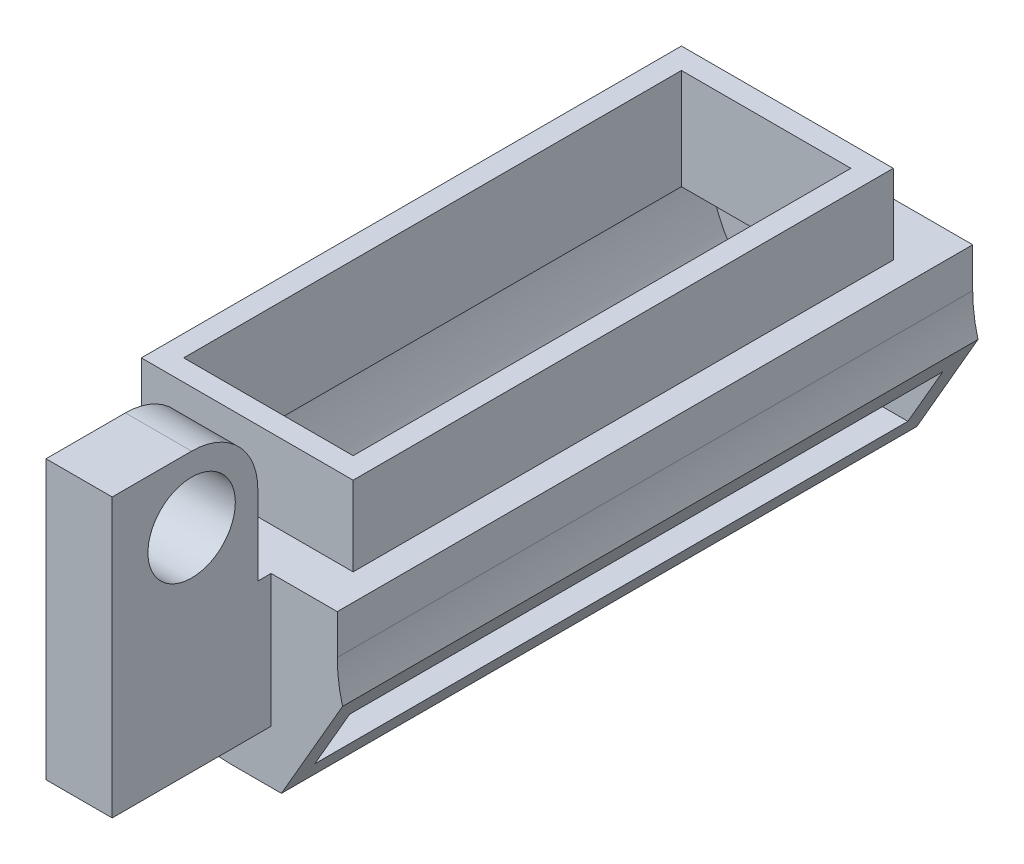
ISO-10303-21;
HEADER;
FILE_DESCRIPTION(('STEP AP214'),'2;1');
FILE_NAME('part.step','',(''),(''),'','','');
FILE_SCHEMA(('AUTOMOTIVE_DESIGN { 1 0 10303 214 1 1 1 1 }'));
ENDSEC;
DATA;
#1=APPLICATION_CONTEXT('core data for automotive mechanical design processes');
#2=APPLICATION_PROTOCOL_DEFINITION('international standard','automotive_design',2000,#1);
#3=PRODUCT_CONTEXT('',#1,'mechanical');
#4=PRODUCT('Part','Part','',(#3));
#5=PRODUCT_RELATED_PRODUCT_CATEGORY('part','',(#4));
#6=PRODUCT_DEFINITION_FORMATION('','',#4);
#7=PRODUCT_DEFINITION_CONTEXT('part definition',#1,'design');
#8=PRODUCT_DEFINITION('design','',#6,#7);
#9=PRODUCT_DEFINITION_SHAPE('','',#8);
#10=(LENGTH_UNIT() NAMED_UNIT(*) SI_UNIT(.MILLI.,.METRE.));
#11=(NAMED_UNIT(*) PLANE_ANGLE_UNIT() SI_UNIT($,.RADIAN.));
#12=(NAMED_UNIT(*) SI_UNIT($,.STERADIAN.) SOLID_ANGLE_UNIT());
#13=UNCERTAINTY_MEASURE_WITH_UNIT(LENGTH_MEASURE(1.E-05),#10,'distance_accuracy_value','');
#14=(GEOMETRIC_REPRESENTATION_CONTEXT(3) GLOBAL_UNCERTAINTY_ASSIGNED_CONTEXT((#13)) GLOBAL_UNIT_ASSIGNED_CONTEXT((#10,
#11,#12)) REPRESENTATION_CONTEXT('',''));
#15=CARTESIAN_POINT('',(0.,0.,0.));
#16=DIRECTION('',(0.,0.,1.));
#17=DIRECTION('',(1.,0.,0.));
#18=AXIS2_PLACEMENT_3D('',#15,#16,#17);
#19=CARTESIAN_POINT('',(5.2,-3.,12.));
#20=DIRECTION('',(-0.86602540378444,0.499999999999998,0.));
#21=DIRECTION('',(-0.499999999999998,-0.86602540378444,0.));
#22=AXIS2_PLACEMENT_3D('',#19,#20,#21);
#23=PLANE('',#22);
#24=DIRECTION('',(0.499999999999998,0.86602540378444,0.));
#25=VECTOR('',#24,1.);
#26=CARTESIAN_POINT('',(5.2,-3.,-12.));
#27=LINE('',#26,#25);
#28=CARTESIAN_POINT('',(2.89059892324151,-7.,-12.));
#29=VERTEX_POINT('',#28);
#30=CARTESIAN_POINT('',(5.2,-3.,-12.));
#31=VERTEX_POINT('',#30);
#32=EDGE_CURVE('E282',#29,#31,#27,.T.);
#33=ORIENTED_EDGE('',*,*,#32,.T.);
#34=DIRECTION('',(0.,0.,-1.));
#35=VECTOR('',#34,1.);
#36=CARTESIAN_POINT('',(5.2,-3.,12.));
#37=LINE('',#36,#35);
#38=CARTESIAN_POINT('',(5.2,-3.,12.));
#39=VERTEX_POINT('',#38);
#40=EDGE_CURVE('E288',#39,#31,#37,.T.);
#41=ORIENTED_EDGE('',*,*,#40,.F.);
#42=DIRECTION('',(0.499999999999998,0.86602540378444,0.));
#43=VECTOR('',#42,1.);
#44=CARTESIAN_POINT('',(5.2,-3.,12.));
#45=LINE('',#44,#43);
#46=CARTESIAN_POINT('',(2.89059892324151,-7.,12.));
#47=VERTEX_POINT('',#46);
#48=EDGE_CURVE('E265',#47,#39,#45,.T.);
#49=ORIENTED_EDGE('',*,*,#48,.F.);
#50=DIRECTION('',(0.,0.,-1.));
#51=VECTOR('',#50,1.);
#52=CARTESIAN_POINT('',(2.89059892324151,-7.,12.));
#53=LINE('',#52,#51);
#54=EDGE_CURVE('E291',#47,#29,#53,.T.);
#55=ORIENTED_EDGE('',*,*,#54,.T.);
#56=EDGE_LOOP('',(#33,#41,#49,#55));
#57=FACE_BOUND('',#56,.T.);
#58=DIRECTION('',(0.499999999999998,0.86602540378444,0.));
#59=VECTOR('',#58,1.);
#60=CARTESIAN_POINT('',(5.01602540378445,-3.31865334794731,-11.2));
#61=LINE('',#60,#59);
#62=CARTESIAN_POINT('',(3.35247913859321,-6.2,-11.2));
#63=VERTEX_POINT('',#62);
#64=CARTESIAN_POINT('',(4.6667832989844,-3.92355841760328,-11.2));
#65=VERTEX_POINT('',#64);
#66=EDGE_CURVE('E400',#63,#65,#61,.T.);
#67=ORIENTED_EDGE('',*,*,#66,.F.);
#68=DIRECTION('',(0.,0.,-1.));
#69=VECTOR('',#68,1.);
#70=CARTESIAN_POINT('',(3.35247913859321,-6.2,12.));
#71=LINE('',#70,#69);
#72=CARTESIAN_POINT('',(3.35247913859321,-6.2,11.2));
#73=VERTEX_POINT('',#72);
#74=EDGE_CURVE('E416',#73,#63,#71,.T.);
#75=ORIENTED_EDGE('',*,*,#74,.F.);
#76=DIRECTION('',(0.499999999999998,0.86602540378444,0.));
#77=VECTOR('',#76,1.);
#78=CARTESIAN_POINT('',(5.01602540378445,-3.31865334794731,11.2));
#79=LINE('',#78,#77);
#80=CARTESIAN_POINT('',(4.6667832989844,-3.92355841760328,11.2));
#81=VERTEX_POINT('',#80);
#82=EDGE_CURVE('E56',#73,#81,#79,.T.);
#83=ORIENTED_EDGE('',*,*,#82,.T.);
#84=DIRECTION('',(0.,0.,-1.));
#85=VECTOR('',#84,1.);
#86=CARTESIAN_POINT('',(4.6667832989844,-3.92355841760328,11.2));
#87=LINE('',#86,#85);
#88=EDGE_CURVE('E397',#81,#65,#87,.T.);
#89=ORIENTED_EDGE('',*,*,#88,.T.);
#90=EDGE_LOOP('',(#67,#75,#83,#89));
#91=FACE_BOUND('',#90,.T.);
#92=ADVANCED_FACE('F33',(#57,#91),#23,.F.);
#93=CARTESIAN_POINT('',(0.,3.,0.));
#94=DIRECTION('',(0.,-1.,0.));
#95=DIRECTION('',(1.,0.,0.));
#96=AXIS2_PLACEMENT_3D('',#93,#94,#95);
#97=PLANE('',#96);
#98=DIRECTION('',(0.,0.,-1.));
#99=VECTOR('',#98,1.);
#100=CARTESIAN_POINT('',(4.,3.,10.4));
#101=LINE('',#100,#99);
#102=CARTESIAN_POINT('',(4.,3.,10.4));
#103=VERTEX_POINT('',#102);
#104=CARTESIAN_POINT('',(4.,3.,-10.));
#105=VERTEX_POINT('',#104);
#106=EDGE_CURVE('E443',#103,#105,#101,.T.);
#107=ORIENTED_EDGE('',*,*,#106,.T.);
#108=DIRECTION('',(-1.,0.,0.));
#109=VECTOR('',#108,1.);
#110=CARTESIAN_POINT('',(-4.,3.,-10.));
#111=LINE('',#110,#109);
#112=CARTESIAN_POINT('',(-4.,3.,-10.));
#113=VERTEX_POINT('',#112);
#114=EDGE_CURVE('E446',#105,#113,#111,.T.);
#115=ORIENTED_EDGE('',*,*,#114,.T.);
#116=DIRECTION('',(0.,0.,1.));
#117=VECTOR('',#116,1.);
#118=CARTESIAN_POINT('',(-4.,3.,10.4));
#119=LINE('',#118,#117);
#120=CARTESIAN_POINT('',(-4.,3.,10.4));
#121=VERTEX_POINT('',#120);
#122=EDGE_CURVE('E449',#113,#121,#119,.T.);
#123=ORIENTED_EDGE('',*,*,#122,.T.);
#124=DIRECTION('',(1.,0.,0.));
#125=VECTOR('',#124,1.);
#126=CARTESIAN_POINT('',(-4.,3.,10.4));
#127=LINE('',#126,#125);
#128=EDGE_CURVE('E451',#121,#103,#127,.T.);
#129=ORIENTED_EDGE('',*,*,#128,.T.);
#130=EDGE_LOOP('',(#107,#115,#123,#129));
#131=FACE_BOUND('',#130,.T.);
#132=DIRECTION('',(0.,0.,-1.));
#133=VECTOR('',#132,1.);
#134=CARTESIAN_POINT('',(3.2,3.,0.));
#135=LINE('',#134,#133);
#136=CARTESIAN_POINT('',(3.2,3.,9.6));
#137=VERTEX_POINT('',#136);
#138=CARTESIAN_POINT('',(3.2,3.,-9.2));
#139=VERTEX_POINT('',#138);
#140=EDGE_CURVE('E382',#137,#139,#135,.T.);
#141=ORIENTED_EDGE('',*,*,#140,.F.);
#142=DIRECTION('',(1.,0.,0.));
#143=VECTOR('',#142,1.);
#144=CARTESIAN_POINT('',(0.,3.,9.6));
#145=LINE('',#144,#143);
#146=CARTESIAN_POINT('',(-3.2,3.,9.6));
#147=VERTEX_POINT('',#146);
#148=EDGE_CURVE('E425',#147,#137,#145,.T.);
#149=ORIENTED_EDGE('',*,*,#148,.F.);
#150=DIRECTION('',(0.,0.,1.));
#151=VECTOR('',#150,1.);
#152=CARTESIAN_POINT('',(-3.2,3.,0.));
#153=LINE('',#152,#151);
#154=CARTESIAN_POINT('',(-3.2,3.,-9.2));
#155=VERTEX_POINT('',#154);
#156=EDGE_CURVE('E439',#155,#147,#153,.T.);
#157=ORIENTED_EDGE('',*,*,#156,.F.);
#158=DIRECTION('',(-1.,0.,0.));
#159=VECTOR('',#158,1.);
#160=CARTESIAN_POINT('',(0.,3.,-9.2));
#161=LINE('',#160,#159);
#162=EDGE_CURVE('E437',#139,#155,#161,.T.);
#163=ORIENTED_EDGE('',*,*,#162,.F.);
#164=EDGE_LOOP('',(#141,#149,#157,#163));
#165=FACE_BOUND('',#164,.T.);
#166=ADVANCED_FACE('F488',(#131,#165),#97,.F.);
#167=CARTESIAN_POINT('',(-5.,0.,12.));
#168=DIRECTION('',(0.,-1.,0.));
#169=DIRECTION('',(1.,0.,0.));
#170=AXIS2_PLACEMENT_3D('',#167,#168,#169);
#171=PLANE('',#170);
#172=DIRECTION('',(-1.,0.,0.));
#173=VECTOR('',#172,1.);
#174=CARTESIAN_POINT('',(-5.,0.,-12.));
#175=LINE('',#174,#173);
#176=CARTESIAN_POINT('',(5.,0.,-12.));
#177=VERTEX_POINT('',#176);
#178=CARTESIAN_POINT('',(-5.,0.,-12.));
#179=VERTEX_POINT('',#178);
#180=EDGE_CURVE('E273',#177,#179,#175,.T.);
#181=ORIENTED_EDGE('',*,*,#180,.T.);
#182=DIRECTION('',(0.,0.,-1.));
#183=VECTOR('',#182,1.);
#184=CARTESIAN_POINT('',(-5.,0.,12.));
#185=LINE('',#184,#183);
#186=CARTESIAN_POINT('',(-5.,0.,12.));
#187=VERTEX_POINT('',#186);
#188=EDGE_CURVE('E41',#187,#179,#185,.T.);
#189=ORIENTED_EDGE('',*,*,#188,.F.);
#190=DIRECTION('',(-1.,0.,0.));
#191=VECTOR('',#190,1.);
#192=CARTESIAN_POINT('',(-5.,0.,12.));
#193=LINE('',#192,#191);
#194=CARTESIAN_POINT('',(0.,0.,12.));
#195=VERTEX_POINT('',#194);
#196=EDGE_CURVE('E255',#195,#187,#193,.T.);
#197=ORIENTED_EDGE('',*,*,#196,.F.);
#198=DIRECTION('',(0.,0.,1.));
#199=VECTOR('',#198,1.);
#200=CARTESIAN_POINT('',(0.,0.,12.));
#201=LINE('',#200,#199);
#202=CARTESIAN_POINT('',(0.,0.,12.5));
#203=VERTEX_POINT('',#202);
#204=EDGE_CURVE('E323',#195,#203,#201,.T.);
#205=ORIENTED_EDGE('',*,*,#204,.T.);
#206=DIRECTION('',(-1.,0.,0.));
#207=VECTOR('',#206,1.);
#208=CARTESIAN_POINT('',(2.5,0.,12.5));
#209=LINE('',#208,#207);
#210=CARTESIAN_POINT('',(2.5,0.,12.5));
#211=VERTEX_POINT('',#210);
#212=EDGE_CURVE('E234',#211,#203,#209,.T.);
#213=ORIENTED_EDGE('',*,*,#212,.F.);
#214=DIRECTION('',(0.,0.,1.));
#215=VECTOR('',#214,1.);
#216=CARTESIAN_POINT('',(2.5,0.,12.));
#217=LINE('',#216,#215);
#218=CARTESIAN_POINT('',(2.5,0.,12.));
#219=VERTEX_POINT('',#218);
#220=EDGE_CURVE('E226',#219,#211,#217,.T.);
#221=ORIENTED_EDGE('',*,*,#220,.F.);
#222=CARTESIAN_POINT('',(5.,0.,12.));
#223=VERTEX_POINT('',#222);
#224=EDGE_CURVE('E231',#223,#219,#193,.T.);
#225=ORIENTED_EDGE('',*,*,#224,.F.);
#226=DIRECTION('',(0.,0.,-1.));
#227=VECTOR('',#226,1.);
#228=CARTESIAN_POINT('',(5.,0.,12.));
#229=LINE('',#228,#227);
#230=EDGE_CURVE('E11',#223,#177,#229,.T.);
#231=ORIENTED_EDGE('',*,*,#230,.T.);
#232=EDGE_LOOP('',(#181,#189,#197,#205,#213,#221,#225,#231));
#233=FACE_BOUND('',#232,.T.);
#234=DIRECTION('',(0.,0.,-1.));
#235=VECTOR('',#234,1.);
#236=CARTESIAN_POINT('',(4.,0.,10.4));
#237=LINE('',#236,#235);
#238=CARTESIAN_POINT('',(4.,0.,10.4));
#239=VERTEX_POINT('',#238);
#240=CARTESIAN_POINT('',(4.,0.,-10.));
#241=VERTEX_POINT('',#240);
#242=EDGE_CURVE('E375',#239,#241,#237,.T.);
#243=ORIENTED_EDGE('',*,*,#242,.F.);
#244=DIRECTION('',(1.,0.,0.));
#245=VECTOR('',#244,1.);
#246=CARTESIAN_POINT('',(-4.,0.,10.4));
#247=LINE('',#246,#245);
#248=CARTESIAN_POINT('',(-4.,0.,10.4));
#249=VERTEX_POINT('',#248);
#250=EDGE_CURVE('E447',#249,#239,#247,.T.);
#251=ORIENTED_EDGE('',*,*,#250,.F.);
#252=DIRECTION('',(0.,0.,1.));
#253=VECTOR('',#252,1.);
#254=CARTESIAN_POINT('',(-4.,0.,10.4));
#255=LINE('',#254,#253);
#256=CARTESIAN_POINT('',(-4.,0.,-10.));
#257=VERTEX_POINT('',#256);
#258=EDGE_CURVE('E459',#257,#249,#255,.T.);
#259=ORIENTED_EDGE('',*,*,#258,.F.);
#260=DIRECTION('',(-1.,0.,0.));
#261=VECTOR('',#260,1.);
#262=CARTESIAN_POINT('',(-4.,0.,-10.));
#263=LINE('',#262,#261);
#264=EDGE_CURVE('E456',#241,#257,#263,.T.);
#265=ORIENTED_EDGE('',*,*,#264,.F.);
#266=EDGE_LOOP('',(#243,#251,#259,#265));
#267=FACE_BOUND('',#266,.T.);
#268=ADVANCED_FACE('F228',(#233,#267),#171,.F.);
#269=CARTESIAN_POINT('',(5.,-1.5,12.));
#270=DIRECTION('',(-1.,0.,0.));
#271=DIRECTION('',(0.,0.,1.));
#272=AXIS2_PLACEMENT_3D('',#269,#270,#271);
#273=PLANE('',#272);
#274=DIRECTION('',(0.,1.,0.));
#275=VECTOR('',#274,1.);
#276=CARTESIAN_POINT('',(5.,-1.5,-12.));
#277=LINE('',#276,#275);
#278=CARTESIAN_POINT('',(5.,-1.5,-12.));
#279=VERTEX_POINT('',#278);
#280=EDGE_CURVE('E270',#279,#177,#277,.T.);
#281=ORIENTED_EDGE('',*,*,#280,.T.);
#282=ORIENTED_EDGE('',*,*,#230,.F.);
#283=DIRECTION('',(0.,1.,0.));
#284=VECTOR('',#283,1.);
#285=CARTESIAN_POINT('',(5.,-1.5,12.));
#286=LINE('',#285,#284);
#287=CARTESIAN_POINT('',(5.,-1.5,12.));
#288=VERTEX_POINT('',#287);
#289=EDGE_CURVE('E252',#288,#223,#286,.T.);
#290=ORIENTED_EDGE('',*,*,#289,.F.);
#291=DIRECTION('',(0.,0.,-1.));
#292=VECTOR('',#291,1.);
#293=CARTESIAN_POINT('',(5.,-1.5,12.));
#294=LINE('',#293,#292);
#295=EDGE_CURVE('E269',#288,#279,#294,.T.);
#296=ORIENTED_EDGE('',*,*,#295,.T.);
#297=EDGE_LOOP('',(#281,#282,#290,#296));
#298=FACE_BOUND('',#297,.T.);
#299=ADVANCED_FACE('F35',(#298),#273,.F.);
#300=CARTESIAN_POINT('',(-5.,-1.,12.));
#301=DIRECTION('',(1.,0.,0.));
#302=DIRECTION('',(0.,1.,0.));
#303=AXIS2_PLACEMENT_3D('',#300,#301,#302);
#304=PLANE('',#303);
#305=DIRECTION('',(0.,-1.,0.));
#306=VECTOR('',#305,1.);
#307=CARTESIAN_POINT('',(-5.,-1.,-12.));
#308=LINE('',#307,#306);
#309=CARTESIAN_POINT('',(-5.,-1.,-12.));
#310=VERTEX_POINT('',#309);
#311=EDGE_CURVE('E276',#179,#310,#308,.T.);
#312=ORIENTED_EDGE('',*,*,#311,.T.);
#313=DIRECTION('',(0.,0.,-1.));
#314=VECTOR('',#313,1.);
#315=CARTESIAN_POINT('',(-5.,-1.,12.));
#316=LINE('',#315,#314);
#317=CARTESIAN_POINT('',(-5.,-1.,12.));
#318=VERTEX_POINT('',#317);
#319=EDGE_CURVE('E297',#318,#310,#316,.T.);
#320=ORIENTED_EDGE('',*,*,#319,.F.);
#321=DIRECTION('',(0.,-1.,0.));
#322=VECTOR('',#321,1.);
#323=CARTESIAN_POINT('',(-5.,-1.,12.));
#324=LINE('',#323,#322);
#325=EDGE_CURVE('E254',#187,#318,#324,.T.);
#326=ORIENTED_EDGE('',*,*,#325,.F.);
#327=ORIENTED_EDGE('',*,*,#188,.T.);
#328=EDGE_LOOP('',(#312,#320,#326,#327));
#329=FACE_BOUND('',#328,.T.);
#330=ADVANCED_FACE('F304',(#329),#304,.F.);
#331=CARTESIAN_POINT('',(1.,-1.,12.));
#332=DIRECTION('',(0.,0.,-1.));
#333=DIRECTION('',(-1.,0.,0.));
#334=AXIS2_PLACEMENT_3D('',#331,#332,#333);
#335=CYLINDRICAL_SURFACE('',#334,6.);
#336=CARTESIAN_POINT('',(1.,-1.,-12.));
#337=DIRECTION('',(0.,0.,1.));
#338=DIRECTION('',(-1.,0.,0.));
#339=AXIS2_PLACEMENT_3D('',#336,#337,#338);
#340=CIRCLE('',#339,6.);
#341=CARTESIAN_POINT('',(1.,-7.,-12.));
#342=VERTEX_POINT('',#341);
#343=EDGE_CURVE('E278',#310,#342,#340,.T.);
#344=ORIENTED_EDGE('',*,*,#343,.T.);
#345=DIRECTION('',(0.,0.,-1.));
#346=VECTOR('',#345,1.);
#347=CARTESIAN_POINT('',(1.,-7.,12.));
#348=LINE('',#347,#346);
#349=CARTESIAN_POINT('',(1.,-7.,12.));
#350=VERTEX_POINT('',#349);
#351=EDGE_CURVE('E294',#350,#342,#348,.T.);
#352=ORIENTED_EDGE('',*,*,#351,.F.);
#353=CARTESIAN_POINT('',(1.,-1.,12.));
#354=DIRECTION('',(0.,0.,1.));
#355=DIRECTION('',(-1.,0.,0.));
#356=AXIS2_PLACEMENT_3D('',#353,#354,#355);
#357=CIRCLE('',#356,6.);
#358=EDGE_CURVE('E257',#318,#350,#357,.T.);
#359=ORIENTED_EDGE('',*,*,#358,.F.);
#360=ORIENTED_EDGE('',*,*,#319,.T.);
#361=EDGE_LOOP('',(#344,#352,#359,#360));
#362=FACE_BOUND('',#361,.T.);
#363=ADVANCED_FACE('F315',(#362),#335,.T.);
#364=CARTESIAN_POINT('',(2.89059892324151,-7.,12.));
#365=DIRECTION('',(0.,1.,0.));
#366=DIRECTION('',(0.,0.,1.));
#367=AXIS2_PLACEMENT_3D('',#364,#365,#366);
#368=PLANE('',#367);
#369=DIRECTION('',(1.,0.,0.));
#370=VECTOR('',#369,1.);
#371=CARTESIAN_POINT('',(2.89059892324151,-7.,-12.));
#372=LINE('',#371,#370);
#373=EDGE_CURVE('E280',#342,#29,#372,.T.);
#374=ORIENTED_EDGE('',*,*,#373,.T.);
#375=ORIENTED_EDGE('',*,*,#54,.F.);
#376=DIRECTION('',(1.,0.,0.));
#377=VECTOR('',#376,1.);
#378=CARTESIAN_POINT('',(2.89059892324151,-7.,12.));
#379=LINE('',#378,#377);
#380=EDGE_CURVE('E263',#350,#47,#379,.T.);
#381=ORIENTED_EDGE('',*,*,#380,.F.);
#382=ORIENTED_EDGE('',*,*,#351,.T.);
#383=EDGE_LOOP('',(#374,#375,#381,#382));
#384=FACE_BOUND('',#383,.T.);
#385=ADVANCED_FACE('F319',(#384),#368,.F.);
#386=CARTESIAN_POINT('',(10.7250000000001,-1.49999999999999,12.));
#387=DIRECTION('',(0.,0.,-1.));
#388=DIRECTION('',(-1.,0.,0.));
#389=AXIS2_PLACEMENT_3D('',#386,#387,#388);
#390=CYLINDRICAL_SURFACE('',#389,5.72500000000009);
#391=CARTESIAN_POINT('',(10.7250000000001,-1.49999999999999,-12.));
#392=DIRECTION('',(0.,0.,-1.));
#393=DIRECTION('',(1.,0.,0.));
#394=AXIS2_PLACEMENT_3D('',#391,#392,#393);
#395=CIRCLE('',#394,5.72500000000009);
#396=EDGE_CURVE('E284',#31,#279,#395,.T.);
#397=ORIENTED_EDGE('',*,*,#396,.T.);
#398=ORIENTED_EDGE('',*,*,#295,.F.);
#399=CARTESIAN_POINT('',(10.7250000000001,-1.49999999999999,12.));
#400=DIRECTION('',(0.,0.,-1.));
#401=DIRECTION('',(1.,0.,0.));
#402=AXIS2_PLACEMENT_3D('',#399,#400,#401);
#403=CIRCLE('',#402,5.72500000000009);
#404=EDGE_CURVE('E267',#39,#288,#403,.T.);
#405=ORIENTED_EDGE('',*,*,#404,.F.);
#406=ORIENTED_EDGE('',*,*,#40,.T.);
#407=EDGE_LOOP('',(#397,#398,#405,#406));
#408=FACE_BOUND('',#407,.T.);
#409=ADVANCED_FACE('F525',(#408),#390,.F.);
#410=CARTESIAN_POINT('',(1.,-1.,12.));
#411=DIRECTION('',(0.,0.,-1.));
#412=DIRECTION('',(-1.,0.,0.));
#413=AXIS2_PLACEMENT_3D('',#410,#411,#412);
#414=PLANE('',#413);
#415=DIRECTION('',(-1.,0.,0.));
#416=VECTOR('',#415,1.);
#417=CARTESIAN_POINT('',(2.5,-5.,12.));
#418=LINE('',#417,#416);
#419=CARTESIAN_POINT('',(2.5,-5.,12.));
#420=VERTEX_POINT('',#419);
#421=CARTESIAN_POINT('',(0.,-5.,12.));
#422=VERTEX_POINT('',#421);
#423=EDGE_CURVE('E348',#420,#422,#418,.T.);
#424=ORIENTED_EDGE('',*,*,#423,.T.);
#425=DIRECTION('',(0.,1.,0.));
#426=VECTOR('',#425,1.);
#427=CARTESIAN_POINT('',(0.,-5.,12.));
#428=LINE('',#427,#426);
#429=EDGE_CURVE('E48',#422,#195,#428,.T.);
#430=ORIENTED_EDGE('',*,*,#429,.T.);
#431=ORIENTED_EDGE('',*,*,#196,.T.);
#432=ORIENTED_EDGE('',*,*,#325,.T.);
#433=ORIENTED_EDGE('',*,*,#358,.T.);
#434=ORIENTED_EDGE('',*,*,#380,.T.);
#435=ORIENTED_EDGE('',*,*,#48,.T.);
#436=ORIENTED_EDGE('',*,*,#404,.T.);
#437=ORIENTED_EDGE('',*,*,#289,.T.);
#438=ORIENTED_EDGE('',*,*,#224,.T.);
#439=DIRECTION('',(0.,1.,0.));
#440=VECTOR('',#439,1.);
#441=CARTESIAN_POINT('',(2.5,-5.,12.));
#442=LINE('',#441,#440);
#443=EDGE_CURVE('E238',#420,#219,#442,.T.);
#444=ORIENTED_EDGE('',*,*,#443,.F.);
#445=EDGE_LOOP('',(#424,#430,#431,#432,#433,#434,#435,#436,#437,#438,#444));
#446=FACE_BOUND('',#445,.T.);
#447=ADVANCED_FACE('F250',(#446),#414,.F.);
#448=CARTESIAN_POINT('',(1.,-1.,-12.));
#449=DIRECTION('',(0.,0.,-1.));
#450=DIRECTION('',(-1.,0.,0.));
#451=AXIS2_PLACEMENT_3D('',#448,#449,#450);
#452=PLANE('',#451);
#453=ORIENTED_EDGE('',*,*,#280,.F.);
#454=ORIENTED_EDGE('',*,*,#396,.F.);
#455=ORIENTED_EDGE('',*,*,#32,.F.);
#456=ORIENTED_EDGE('',*,*,#373,.F.);
#457=ORIENTED_EDGE('',*,*,#343,.F.);
#458=ORIENTED_EDGE('',*,*,#311,.F.);
#459=ORIENTED_EDGE('',*,*,#180,.F.);
#460=EDGE_LOOP('',(#453,#454,#455,#456,#457,#458,#459));
#461=FACE_BOUND('',#460,.T.);
#462=ADVANCED_FACE('F310',(#461),#452,.T.);
#463=CARTESIAN_POINT('',(4.,3.,10.4));
#464=DIRECTION('',(-1.,0.,0.));
#465=DIRECTION('',(0.,-1.,0.));
#466=AXIS2_PLACEMENT_3D('',#463,#464,#465);
#467=PLANE('',#466);
#468=ORIENTED_EDGE('',*,*,#242,.T.);
#469=DIRECTION('',(0.,-1.,0.));
#470=VECTOR('',#469,1.);
#471=CARTESIAN_POINT('',(4.,3.,-10.));
#472=LINE('',#471,#470);
#473=EDGE_CURVE('E274',#105,#241,#472,.T.);
#474=ORIENTED_EDGE('',*,*,#473,.F.);
#475=ORIENTED_EDGE('',*,*,#106,.F.);
#476=DIRECTION('',(0.,-1.,0.));
#477=VECTOR('',#476,1.);
#478=CARTESIAN_POINT('',(4.,3.,10.4));
#479=LINE('',#478,#477);
#480=EDGE_CURVE('E453',#103,#239,#479,.T.);
#481=ORIENTED_EDGE('',*,*,#480,.T.);
#482=EDGE_LOOP('',(#468,#474,#475,#481));
#483=FACE_BOUND('',#482,.T.);
#484=ADVANCED_FACE('F478',(#483),#467,.F.);
#485=CARTESIAN_POINT('',(-4.,3.,-10.));
#486=DIRECTION('',(0.,0.,1.));
#487=DIRECTION('',(1.,0.,0.));
#488=AXIS2_PLACEMENT_3D('',#485,#486,#487);
#489=PLANE('',#488);
#490=ORIENTED_EDGE('',*,*,#264,.T.);
#491=DIRECTION('',(0.,-1.,0.));
#492=VECTOR('',#491,1.);
#493=CARTESIAN_POINT('',(-4.,3.,-10.));
#494=LINE('',#493,#492);
#495=EDGE_CURVE('E469',#113,#257,#494,.T.);
#496=ORIENTED_EDGE('',*,*,#495,.F.);
#497=ORIENTED_EDGE('',*,*,#114,.F.);
#498=ORIENTED_EDGE('',*,*,#473,.T.);
#499=EDGE_LOOP('',(#490,#496,#497,#498));
#500=FACE_BOUND('',#499,.T.);
#501=ADVANCED_FACE('F474',(#500),#489,.F.);
#502=CARTESIAN_POINT('',(-4.,3.,10.4));
#503=DIRECTION('',(1.,0.,0.));
#504=DIRECTION('',(0.,1.,0.));
#505=AXIS2_PLACEMENT_3D('',#502,#503,#504);
#506=PLANE('',#505);
#507=ORIENTED_EDGE('',*,*,#258,.T.);
#508=DIRECTION('',(0.,-1.,0.));
#509=VECTOR('',#508,1.);
#510=CARTESIAN_POINT('',(-4.,3.,10.4));
#511=LINE('',#510,#509);
#512=EDGE_CURVE('E466',#121,#249,#511,.T.);
#513=ORIENTED_EDGE('',*,*,#512,.F.);
#514=ORIENTED_EDGE('',*,*,#122,.F.);
#515=ORIENTED_EDGE('',*,*,#495,.T.);
#516=EDGE_LOOP('',(#507,#513,#514,#515));
#517=FACE_BOUND('',#516,.T.);
#518=ADVANCED_FACE('F486',(#517),#506,.F.);
#519=CARTESIAN_POINT('',(-4.,3.,10.4));
#520=DIRECTION('',(0.,0.,-1.));
#521=DIRECTION('',(-1.,0.,0.));
#522=AXIS2_PLACEMENT_3D('',#519,#520,#521);
#523=PLANE('',#522);
#524=ORIENTED_EDGE('',*,*,#250,.T.);
#525=ORIENTED_EDGE('',*,*,#480,.F.);
#526=ORIENTED_EDGE('',*,*,#128,.F.);
#527=ORIENTED_EDGE('',*,*,#512,.T.);
#528=EDGE_LOOP('',(#524,#525,#526,#527));
#529=FACE_BOUND('',#528,.T.);
#530=ADVANCED_FACE('F481',(#529),#523,.F.);
#531=CARTESIAN_POINT('',(-5.,-0.8,12.));
#532=DIRECTION('',(0.,-1.,0.));
#533=DIRECTION('',(1.,0.,0.));
#534=AXIS2_PLACEMENT_3D('',#531,#532,#533);
#535=PLANE('',#534);
#536=DIRECTION('',(-1.,0.,0.));
#537=VECTOR('',#536,1.);
#538=CARTESIAN_POINT('',(1.,-0.8,-11.2));
#539=LINE('',#538,#537);
#540=CARTESIAN_POINT('',(4.2,-0.8,-11.2));
#541=VERTEX_POINT('',#540);
#542=CARTESIAN_POINT('',(-4.2,-0.8,-11.2));
#543=VERTEX_POINT('',#542);
#544=EDGE_CURVE('E360',#541,#543,#539,.T.);
#545=ORIENTED_EDGE('',*,*,#544,.F.);
#546=DIRECTION('',(0.,0.,-1.));
#547=VECTOR('',#546,1.);
#548=CARTESIAN_POINT('',(4.2,-0.8,12.));
#549=LINE('',#548,#547);
#550=CARTESIAN_POINT('',(4.2,-0.8,11.2));
#551=VERTEX_POINT('',#550);
#552=EDGE_CURVE('E367',#551,#541,#549,.T.);
#553=ORIENTED_EDGE('',*,*,#552,.F.);
#554=DIRECTION('',(-1.,0.,0.));
#555=VECTOR('',#554,1.);
#556=CARTESIAN_POINT('',(1.,-0.8,11.2));
#557=LINE('',#556,#555);
#558=CARTESIAN_POINT('',(-4.2,-0.8,11.2));
#559=VERTEX_POINT('',#558);
#560=EDGE_CURVE('E369',#551,#559,#557,.T.);
#561=ORIENTED_EDGE('',*,*,#560,.T.);
#562=DIRECTION('',(0.,0.,-1.));
#563=VECTOR('',#562,1.);
#564=CARTESIAN_POINT('',(-4.2,-0.8,12.));
#565=LINE('',#564,#563);
#566=EDGE_CURVE('E364',#559,#543,#565,.T.);
#567=ORIENTED_EDGE('',*,*,#566,.T.);
#568=EDGE_LOOP('',(#545,#553,#561,#567));
#569=FACE_BOUND('',#568,.T.);
#570=DIRECTION('',(0.,0.,-1.));
#571=VECTOR('',#570,1.);
#572=CARTESIAN_POINT('',(3.2,-0.8,12.));
#573=LINE('',#572,#571);
#574=CARTESIAN_POINT('',(3.2,-0.8,9.6));
#575=VERTEX_POINT('',#574);
#576=CARTESIAN_POINT('',(3.2,-0.8,-9.2));
#577=VERTEX_POINT('',#576);
#578=EDGE_CURVE('E331',#575,#577,#573,.T.);
#579=ORIENTED_EDGE('',*,*,#578,.T.);
#580=DIRECTION('',(-1.,0.,0.));
#581=VECTOR('',#580,1.);
#582=CARTESIAN_POINT('',(-5.,-0.8,-9.2));
#583=LINE('',#582,#581);
#584=CARTESIAN_POINT('',(-3.2,-0.8,-9.2));
#585=VERTEX_POINT('',#584);
#586=EDGE_CURVE('E378',#577,#585,#583,.T.);
#587=ORIENTED_EDGE('',*,*,#586,.T.);
#588=DIRECTION('',(0.,0.,1.));
#589=VECTOR('',#588,1.);
#590=CARTESIAN_POINT('',(-3.2,-0.8,12.));
#591=LINE('',#590,#589);
#592=CARTESIAN_POINT('',(-3.2,-0.8,9.6));
#593=VERTEX_POINT('',#592);
#594=EDGE_CURVE('E383',#585,#593,#591,.T.);
#595=ORIENTED_EDGE('',*,*,#594,.T.);
#596=DIRECTION('',(1.,0.,0.));
#597=VECTOR('',#596,1.);
#598=CARTESIAN_POINT('',(-5.,-0.8,9.6));
#599=LINE('',#598,#597);
#600=EDGE_CURVE('E379',#593,#575,#599,.T.);
#601=ORIENTED_EDGE('',*,*,#600,.T.);
#602=EDGE_LOOP('',(#579,#587,#595,#601));
#603=FACE_BOUND('',#602,.T.);
#604=ADVANCED_FACE('F504',(#569,#603),#535,.T.);
#605=CARTESIAN_POINT('',(4.2,-1.5,12.));
#606=DIRECTION('',(-1.,0.,0.));
#607=DIRECTION('',(0.,0.,1.));
#608=AXIS2_PLACEMENT_3D('',#605,#606,#607);
#609=PLANE('',#608);
#610=DIRECTION('',(0.,1.,0.));
#611=VECTOR('',#610,1.);
#612=CARTESIAN_POINT('',(4.2,-1.,-11.2));
#613=LINE('',#612,#611);
#614=CARTESIAN_POINT('',(4.2,-1.5,-11.2));
#615=VERTEX_POINT('',#614);
#616=EDGE_CURVE('E363',#615,#541,#613,.T.);
#617=ORIENTED_EDGE('',*,*,#616,.F.);
#618=DIRECTION('',(0.,0.,1.));
#619=VECTOR('',#618,1.);
#620=CARTESIAN_POINT('',(4.2,-1.5,12.));
#621=LINE('',#620,#619);
#622=CARTESIAN_POINT('',(4.2,-1.5,11.2));
#623=VERTEX_POINT('',#622);
#624=EDGE_CURVE('E394',#623,#615,#621,.F.);
#625=ORIENTED_EDGE('',*,*,#624,.F.);
#626=DIRECTION('',(0.,1.,0.));
#627=VECTOR('',#626,1.);
#628=CARTESIAN_POINT('',(4.2,-1.,11.2));
#629=LINE('',#628,#627);
#630=EDGE_CURVE('E372',#623,#551,#629,.T.);
#631=ORIENTED_EDGE('',*,*,#630,.T.);
#632=ORIENTED_EDGE('',*,*,#552,.T.);
#633=EDGE_LOOP('',(#617,#625,#631,#632));
#634=FACE_BOUND('',#633,.T.);
#635=ADVANCED_FACE('F562',(#634),#609,.T.);
#636=CARTESIAN_POINT('',(-4.2,-1.,12.));
#637=DIRECTION('',(1.,0.,0.));
#638=DIRECTION('',(0.,1.,0.));
#639=AXIS2_PLACEMENT_3D('',#636,#637,#638);
#640=PLANE('',#639);
#641=DIRECTION('',(0.,-1.,0.));
#642=VECTOR('',#641,1.);
#643=CARTESIAN_POINT('',(-4.2,-1.00000000000001,-11.2));
#644=LINE('',#643,#642);
#645=CARTESIAN_POINT('',(-4.2,-1.,-11.2));
#646=VERTEX_POINT('',#645);
#647=EDGE_CURVE('E362',#543,#646,#644,.T.);
#648=ORIENTED_EDGE('',*,*,#647,.F.);
#649=ORIENTED_EDGE('',*,*,#566,.F.);
#650=DIRECTION('',(0.,-1.,0.));
#651=VECTOR('',#650,1.);
#652=CARTESIAN_POINT('',(-4.2,-1.00000000000001,11.2));
#653=LINE('',#652,#651);
#654=CARTESIAN_POINT('',(-4.2,-1.,11.2));
#655=VERTEX_POINT('',#654);
#656=EDGE_CURVE('E371',#559,#655,#653,.T.);
#657=ORIENTED_EDGE('',*,*,#656,.T.);
#658=DIRECTION('',(0.,0.,-1.));
#659=VECTOR('',#658,1.);
#660=CARTESIAN_POINT('',(-4.2,-1.,12.));
#661=LINE('',#660,#659);
#662=EDGE_CURVE('E368',#655,#646,#661,.T.);
#663=ORIENTED_EDGE('',*,*,#662,.T.);
#664=EDGE_LOOP('',(#648,#649,#657,#663));
#665=FACE_BOUND('',#664,.T.);
#666=ADVANCED_FACE('F568',(#665),#640,.T.);
#667=CARTESIAN_POINT('',(1.,-1.,12.));
#668=DIRECTION('',(0.,0.,-1.));
#669=DIRECTION('',(-1.,0.,0.));
#670=AXIS2_PLACEMENT_3D('',#667,#668,#669);
#671=CYLINDRICAL_SURFACE('',#670,5.2);
#672=CARTESIAN_POINT('',(1.,-1.,-11.2));
#673=DIRECTION('',(0.,0.,-1.));
#674=DIRECTION('',(-1.,0.,0.));
#675=AXIS2_PLACEMENT_3D('',#672,#673,#674);
#676=CIRCLE('',#675,5.2);
#677=CARTESIAN_POINT('',(1.,-6.2,-11.2));
#678=VERTEX_POINT('',#677);
#679=EDGE_CURVE('E408',#646,#678,#676,.F.);
#680=ORIENTED_EDGE('',*,*,#679,.F.);
#681=ORIENTED_EDGE('',*,*,#662,.F.);
#682=CARTESIAN_POINT('',(1.,-1.,11.2));
#683=DIRECTION('',(0.,0.,-1.));
#684=DIRECTION('',(-1.,0.,0.));
#685=AXIS2_PLACEMENT_3D('',#682,#683,#684);
#686=CIRCLE('',#685,5.2);
#687=CARTESIAN_POINT('',(1.,-6.2,11.2));
#688=VERTEX_POINT('',#687);
#689=EDGE_CURVE('E403',#655,#688,#686,.F.);
#690=ORIENTED_EDGE('',*,*,#689,.T.);
#691=DIRECTION('',(0.,0.,1.));
#692=VECTOR('',#691,1.);
#693=CARTESIAN_POINT('',(1.,-6.2,12.));
#694=LINE('',#693,#692);
#695=EDGE_CURVE('E411',#688,#678,#694,.F.);
#696=ORIENTED_EDGE('',*,*,#695,.T.);
#697=EDGE_LOOP('',(#680,#681,#690,#696));
#698=FACE_BOUND('',#697,.T.);
#699=ADVANCED_FACE('F576',(#698),#671,.F.);
#700=CARTESIAN_POINT('',(2.89059892324151,-6.2,12.));
#701=DIRECTION('',(0.,1.,0.));
#702=DIRECTION('',(0.,0.,1.));
#703=AXIS2_PLACEMENT_3D('',#700,#701,#702);
#704=PLANE('',#703);
#705=DIRECTION('',(1.,0.,0.));
#706=VECTOR('',#705,1.);
#707=CARTESIAN_POINT('',(1.,-6.2,-11.2));
#708=LINE('',#707,#706);
#709=EDGE_CURVE('E413',#678,#63,#708,.T.);
#710=ORIENTED_EDGE('',*,*,#709,.F.);
#711=ORIENTED_EDGE('',*,*,#695,.F.);
#712=DIRECTION('',(1.,0.,0.));
#713=VECTOR('',#712,1.);
#714=CARTESIAN_POINT('',(1.,-6.2,11.2));
#715=LINE('',#714,#713);
#716=EDGE_CURVE('E405',#688,#73,#715,.T.);
#717=ORIENTED_EDGE('',*,*,#716,.T.);
#718=ORIENTED_EDGE('',*,*,#74,.T.);
#719=EDGE_LOOP('',(#710,#711,#717,#718));
#720=FACE_BOUND('',#719,.T.);
#721=ADVANCED_FACE('F580',(#720),#704,.T.);
#722=CARTESIAN_POINT('',(10.7250000000001,-1.49999999999999,12.));
#723=DIRECTION('',(0.,0.,-1.));
#724=DIRECTION('',(-1.,0.,0.));
#725=AXIS2_PLACEMENT_3D('',#722,#723,#724);
#726=CYLINDRICAL_SURFACE('',#725,6.5250000000001);
#727=CARTESIAN_POINT('',(10.7250000000001,-1.49999999999999,-11.2));
#728=DIRECTION('',(0.,0.,-1.));
#729=DIRECTION('',(-1.,0.,0.));
#730=AXIS2_PLACEMENT_3D('',#727,#728,#729);
#731=CIRCLE('',#730,6.5250000000001);
#732=EDGE_CURVE('E393',#65,#615,#731,.T.);
#733=ORIENTED_EDGE('',*,*,#732,.F.);
#734=ORIENTED_EDGE('',*,*,#88,.F.);
#735=CARTESIAN_POINT('',(10.7250000000001,-1.49999999999999,11.2));
#736=DIRECTION('',(0.,0.,-1.));
#737=DIRECTION('',(-1.,0.,0.));
#738=AXIS2_PLACEMENT_3D('',#735,#736,#737);
#739=CIRCLE('',#738,6.5250000000001);
#740=EDGE_CURVE('E398',#81,#623,#739,.T.);
#741=ORIENTED_EDGE('',*,*,#740,.T.);
#742=ORIENTED_EDGE('',*,*,#624,.T.);
#743=EDGE_LOOP('',(#733,#734,#741,#742));
#744=FACE_BOUND('',#743,.T.);
#745=ADVANCED_FACE('F584',(#744),#726,.T.);
#746=CARTESIAN_POINT('',(1.,-1.,11.2));
#747=DIRECTION('',(0.,0.,-1.));
#748=DIRECTION('',(-1.,0.,0.));
#749=AXIS2_PLACEMENT_3D('',#746,#747,#748);
#750=PLANE('',#749);
#751=ORIENTED_EDGE('',*,*,#630,.F.);
#752=ORIENTED_EDGE('',*,*,#740,.F.);
#753=ORIENTED_EDGE('',*,*,#82,.F.);
#754=ORIENTED_EDGE('',*,*,#716,.F.);
#755=ORIENTED_EDGE('',*,*,#689,.F.);
#756=ORIENTED_EDGE('',*,*,#656,.F.);
#757=ORIENTED_EDGE('',*,*,#560,.F.);
#758=EDGE_LOOP('',(#751,#752,#753,#754,#755,#756,#757));
#759=FACE_BOUND('',#758,.T.);
#760=ADVANCED_FACE('F588',(#759),#750,.T.);
#761=CARTESIAN_POINT('',(1.,-1.,-11.2));
#762=DIRECTION('',(0.,0.,-1.));
#763=DIRECTION('',(-1.,0.,0.));
#764=AXIS2_PLACEMENT_3D('',#761,#762,#763);
#765=PLANE('',#764);
#766=ORIENTED_EDGE('',*,*,#616,.T.);
#767=ORIENTED_EDGE('',*,*,#544,.T.);
#768=ORIENTED_EDGE('',*,*,#647,.T.);
#769=ORIENTED_EDGE('',*,*,#679,.T.);
#770=ORIENTED_EDGE('',*,*,#709,.T.);
#771=ORIENTED_EDGE('',*,*,#66,.T.);
#772=ORIENTED_EDGE('',*,*,#732,.T.);
#773=EDGE_LOOP('',(#766,#767,#768,#769,#770,#771,#772));
#774=FACE_BOUND('',#773,.T.);
#775=ADVANCED_FACE('F592',(#774),#765,.F.);
#776=CARTESIAN_POINT('',(3.2,3.,10.4));
#777=DIRECTION('',(-1.,0.,0.));
#778=DIRECTION('',(0.,-1.,0.));
#779=AXIS2_PLACEMENT_3D('',#776,#777,#778);
#780=PLANE('',#779);
#781=ORIENTED_EDGE('',*,*,#578,.F.);
#782=DIRECTION('',(0.,-1.,0.));
#783=VECTOR('',#782,1.);
#784=CARTESIAN_POINT('',(3.2,3.,9.6));
#785=LINE('',#784,#783);
#786=EDGE_CURVE('E421',#137,#575,#785,.T.);
#787=ORIENTED_EDGE('',*,*,#786,.F.);
#788=ORIENTED_EDGE('',*,*,#140,.T.);
#789=DIRECTION('',(0.,-1.,0.));
#790=VECTOR('',#789,1.);
#791=CARTESIAN_POINT('',(3.2,3.,-9.2));
#792=LINE('',#791,#790);
#793=EDGE_CURVE('E390',#139,#577,#792,.T.);
#794=ORIENTED_EDGE('',*,*,#793,.T.);
#795=EDGE_LOOP('',(#781,#787,#788,#794));
#796=FACE_BOUND('',#795,.T.);
#797=ADVANCED_FACE('F499',(#796),#780,.T.);
#798=CARTESIAN_POINT('',(-4.,3.,-9.2));
#799=DIRECTION('',(0.,0.,1.));
#800=DIRECTION('',(1.,0.,0.));
#801=AXIS2_PLACEMENT_3D('',#798,#799,#800);
#802=PLANE('',#801);
#803=ORIENTED_EDGE('',*,*,#586,.F.);
#804=ORIENTED_EDGE('',*,*,#793,.F.);
#805=ORIENTED_EDGE('',*,*,#162,.T.);
#806=DIRECTION('',(0.,-1.,0.));
#807=VECTOR('',#806,1.);
#808=CARTESIAN_POINT('',(-3.2,3.,-9.2));
#809=LINE('',#808,#807);
#810=EDGE_CURVE('E420',#155,#585,#809,.T.);
#811=ORIENTED_EDGE('',*,*,#810,.T.);
#812=EDGE_LOOP('',(#803,#804,#805,#811));
#813=FACE_BOUND('',#812,.T.);
#814=ADVANCED_FACE('F501',(#813),#802,.T.);
#815=CARTESIAN_POINT('',(-3.2,3.,10.4));
#816=DIRECTION('',(1.,0.,0.));
#817=DIRECTION('',(0.,1.,0.));
#818=AXIS2_PLACEMENT_3D('',#815,#816,#817);
#819=PLANE('',#818);
#820=ORIENTED_EDGE('',*,*,#594,.F.);
#821=ORIENTED_EDGE('',*,*,#810,.F.);
#822=ORIENTED_EDGE('',*,*,#156,.T.);
#823=DIRECTION('',(0.,-1.,0.));
#824=VECTOR('',#823,1.);
#825=CARTESIAN_POINT('',(-3.2,3.,9.6));
#826=LINE('',#825,#824);
#827=EDGE_CURVE('E424',#147,#593,#826,.T.);
#828=ORIENTED_EDGE('',*,*,#827,.T.);
#829=EDGE_LOOP('',(#820,#821,#822,#828));
#830=FACE_BOUND('',#829,.T.);
#831=ADVANCED_FACE('F508',(#830),#819,.T.);
#832=CARTESIAN_POINT('',(-4.,3.,9.6));
#833=DIRECTION('',(0.,0.,-1.));
#834=DIRECTION('',(-1.,0.,0.));
#835=AXIS2_PLACEMENT_3D('',#832,#833,#834);
#836=PLANE('',#835);
#837=ORIENTED_EDGE('',*,*,#600,.F.);
#838=ORIENTED_EDGE('',*,*,#827,.F.);
#839=ORIENTED_EDGE('',*,*,#148,.T.);
#840=ORIENTED_EDGE('',*,*,#786,.T.);
#841=EDGE_LOOP('',(#837,#838,#839,#840));
#842=FACE_BOUND('',#841,.T.);
#843=ADVANCED_FACE('F506',(#842),#836,.T.);
#844=CARTESIAN_POINT('',(2.5,3.,15.));
#845=DIRECTION('',(1.,0.,0.));
#846=DIRECTION('',(0.,0.,-1.));
#847=AXIS2_PLACEMENT_3D('',#844,#845,#846);
#848=PLANE('',#847);
#849=ORIENTED_EDGE('',*,*,#443,.T.);
#850=ORIENTED_EDGE('',*,*,#220,.T.);
#851=DIRECTION('',(0.,1.,0.));
#852=VECTOR('',#851,1.);
#853=CARTESIAN_POINT('',(2.5,0.,12.5));
#854=LINE('',#853,#852);
#855=CARTESIAN_POINT('',(2.5,3.,12.5));
#856=VERTEX_POINT('',#855);
#857=EDGE_CURVE('E237',#211,#856,#854,.T.);
#858=ORIENTED_EDGE('',*,*,#857,.T.);
#859=CARTESIAN_POINT('',(2.5,3.,15.));
#860=DIRECTION('',(1.,0.,0.));
#861=DIRECTION('',(0.,0.,-1.));
#862=AXIS2_PLACEMENT_3D('',#859,#860,#861);
#863=CIRCLE('',#862,2.5);
#864=CARTESIAN_POINT('',(2.5,5.5,15.));
#865=VERTEX_POINT('',#864);
#866=EDGE_CURVE('E713',#856,#865,#863,.T.);
#867=ORIENTED_EDGE('',*,*,#866,.T.);
#868=DIRECTION('',(0.,0.,1.));
#869=VECTOR('',#868,1.);
#870=CARTESIAN_POINT('',(2.5,5.5,15.));
#871=LINE('',#870,#869);
#872=CARTESIAN_POINT('',(2.5,5.5,18.));
#873=VERTEX_POINT('',#872);
#874=EDGE_CURVE('E715',#865,#873,#871,.T.);
#875=ORIENTED_EDGE('',*,*,#874,.T.);
#876=DIRECTION('',(0.,-1.,0.));
#877=VECTOR('',#876,1.);
#878=CARTESIAN_POINT('',(2.5,5.5,18.));
#879=LINE('',#878,#877);
#880=CARTESIAN_POINT('',(2.5,-5.,18.));
#881=VERTEX_POINT('',#880);
#882=EDGE_CURVE('E717',#873,#881,#879,.T.);
#883=ORIENTED_EDGE('',*,*,#882,.T.);
#884=DIRECTION('',(0.,0.,-1.));
#885=VECTOR('',#884,1.);
#886=CARTESIAN_POINT('',(2.5,-5.,18.));
#887=LINE('',#886,#885);
#888=EDGE_CURVE('E244',#881,#420,#887,.T.);
#889=ORIENTED_EDGE('',*,*,#888,.T.);
#890=EDGE_LOOP('',(#849,#850,#858,#867,#875,#883,#889));
#891=FACE_BOUND('',#890,.T.);
#892=CARTESIAN_POINT('',(2.5,3.,15.));
#893=DIRECTION('',(1.,0.,0.));
#894=DIRECTION('',(0.,0.,-1.));
#895=AXIS2_PLACEMENT_3D('',#892,#893,#894);
#896=CIRCLE('',#895,1.65);
#897=CARTESIAN_POINT('',(2.5,3.,13.35));
#898=VERTEX_POINT('',#897);
#899=EDGE_CURVE('E705',#898,#898,#896,.T.);
#900=ORIENTED_EDGE('',*,*,#899,.F.);
#901=EDGE_LOOP('',(#900));
#902=FACE_BOUND('',#901,.T.);
#903=ADVANCED_FACE('F241',(#891,#902),#848,.T.);
#904=CARTESIAN_POINT('',(0.,3.,15.));
#905=DIRECTION('',(1.,0.,0.));
#906=DIRECTION('',(0.,0.,-1.));
#907=AXIS2_PLACEMENT_3D('',#904,#905,#906);
#908=PLANE('',#907);
#909=ORIENTED_EDGE('',*,*,#429,.F.);
#910=DIRECTION('',(0.,0.,-1.));
#911=VECTOR('',#910,1.);
#912=CARTESIAN_POINT('',(0.,-5.,18.));
#913=LINE('',#912,#911);
#914=CARTESIAN_POINT('',(0.,-5.,18.));
#915=VERTEX_POINT('',#914);
#916=EDGE_CURVE('E248',#915,#422,#913,.T.);
#917=ORIENTED_EDGE('',*,*,#916,.F.);
#918=DIRECTION('',(0.,-1.,0.));
#919=VECTOR('',#918,1.);
#920=CARTESIAN_POINT('',(0.,5.5,18.));
#921=LINE('',#920,#919);
#922=CARTESIAN_POINT('',(0.,5.5,18.));
#923=VERTEX_POINT('',#922);
#924=EDGE_CURVE('E345',#923,#915,#921,.T.);
#925=ORIENTED_EDGE('',*,*,#924,.F.);
#926=DIRECTION('',(0.,0.,1.));
#927=VECTOR('',#926,1.);
#928=CARTESIAN_POINT('',(0.,5.5,15.));
#929=LINE('',#928,#927);
#930=CARTESIAN_POINT('',(0.,5.5,15.));
#931=VERTEX_POINT('',#930);
#932=EDGE_CURVE('E340',#931,#923,#929,.T.);
#933=ORIENTED_EDGE('',*,*,#932,.F.);
#934=CARTESIAN_POINT('',(0.,3.,15.));
#935=DIRECTION('',(1.,0.,0.));
#936=DIRECTION('',(0.,0.,-1.));
#937=AXIS2_PLACEMENT_3D('',#934,#935,#936);
#938=CIRCLE('',#937,2.5);
#939=CARTESIAN_POINT('',(0.,3.,12.5));
#940=VERTEX_POINT('',#939);
#941=EDGE_CURVE('E338',#940,#931,#938,.T.);
#942=ORIENTED_EDGE('',*,*,#941,.F.);
#943=DIRECTION('',(0.,1.,0.));
#944=VECTOR('',#943,1.);
#945=CARTESIAN_POINT('',(0.,0.,12.5));
#946=LINE('',#945,#944);
#947=EDGE_CURVE('E325',#203,#940,#946,.T.);
#948=ORIENTED_EDGE('',*,*,#947,.F.);
#949=ORIENTED_EDGE('',*,*,#204,.F.);
#950=EDGE_LOOP('',(#909,#917,#925,#933,#942,#948,#949));
#951=FACE_BOUND('',#950,.T.);
#952=CARTESIAN_POINT('',(0.,3.,15.));
#953=DIRECTION('',(1.,0.,0.));
#954=DIRECTION('',(0.,0.,-1.));
#955=AXIS2_PLACEMENT_3D('',#952,#953,#954);
#956=CIRCLE('',#955,1.65);
#957=CARTESIAN_POINT('',(0.,3.,13.35));
#958=VERTEX_POINT('',#957);
#959=EDGE_CURVE('E708',#958,#958,#956,.T.);
#960=ORIENTED_EDGE('',*,*,#959,.T.);
#961=EDGE_LOOP('',(#960));
#962=FACE_BOUND('',#961,.T.);
#963=ADVANCED_FACE('F335',(#951,#962),#908,.F.);
#964=CARTESIAN_POINT('',(2.5,0.,12.5));
#965=DIRECTION('',(0.,0.,1.));
#966=DIRECTION('',(0.,-1.,0.));
#967=AXIS2_PLACEMENT_3D('',#964,#965,#966);
#968=PLANE('',#967);
#969=ORIENTED_EDGE('',*,*,#947,.T.);
#970=DIRECTION('',(-1.,0.,0.));
#971=VECTOR('',#970,1.);
#972=CARTESIAN_POINT('',(2.5,3.,12.5));
#973=LINE('',#972,#971);
#974=EDGE_CURVE('E332',#856,#940,#973,.T.);
#975=ORIENTED_EDGE('',*,*,#974,.F.);
#976=ORIENTED_EDGE('',*,*,#857,.F.);
#977=ORIENTED_EDGE('',*,*,#212,.T.);
#978=EDGE_LOOP('',(#969,#975,#976,#977));
#979=FACE_BOUND('',#978,.T.);
#980=ADVANCED_FACE('F328',(#979),#968,.F.);
#981=CARTESIAN_POINT('',(2.5,3.,15.));
#982=DIRECTION('',(-1.,0.,0.));
#983=DIRECTION('',(0.,0.,1.));
#984=AXIS2_PLACEMENT_3D('',#981,#982,#983);
#985=CYLINDRICAL_SURFACE('',#984,2.5);
#986=ORIENTED_EDGE('',*,*,#941,.T.);
#987=DIRECTION('',(-1.,0.,0.));
#988=VECTOR('',#987,1.);
#989=CARTESIAN_POINT('',(2.5,5.5,15.));
#990=LINE('',#989,#988);
#991=EDGE_CURVE('E356',#865,#931,#990,.T.);
#992=ORIENTED_EDGE('',*,*,#991,.F.);
#993=ORIENTED_EDGE('',*,*,#866,.F.);
#994=ORIENTED_EDGE('',*,*,#974,.T.);
#995=EDGE_LOOP('',(#986,#992,#993,#994));
#996=FACE_BOUND('',#995,.T.);
#997=ADVANCED_FACE('F651',(#996),#985,.T.);
#998=CARTESIAN_POINT('',(2.5,5.5,15.));
#999=DIRECTION('',(0.,-1.,0.));
#1000=DIRECTION('',(0.,0.,-1.));
#1001=AXIS2_PLACEMENT_3D('',#998,#999,#1000);
#1002=PLANE('',#1001);
#1003=ORIENTED_EDGE('',*,*,#932,.T.);
#1004=DIRECTION('',(-1.,0.,0.));
#1005=VECTOR('',#1004,1.);
#1006=CARTESIAN_POINT('',(2.5,5.5,18.));
#1007=LINE('',#1006,#1005);
#1008=EDGE_CURVE('E353',#873,#923,#1007,.T.);
#1009=ORIENTED_EDGE('',*,*,#1008,.F.);
#1010=ORIENTED_EDGE('',*,*,#874,.F.);
#1011=ORIENTED_EDGE('',*,*,#991,.T.);
#1012=EDGE_LOOP('',(#1003,#1009,#1010,#1011));
#1013=FACE_BOUND('',#1012,.T.);
#1014=ADVANCED_FACE('F659',(#1013),#1002,.F.);
#1015=CARTESIAN_POINT('',(2.5,5.5,18.));
#1016=DIRECTION('',(0.,0.,-1.));
#1017=DIRECTION('',(-1.,0.,0.));
#1018=AXIS2_PLACEMENT_3D('',#1015,#1016,#1017);
#1019=PLANE('',#1018);
#1020=ORIENTED_EDGE('',*,*,#924,.T.);
#1021=DIRECTION('',(-1.,0.,0.));
#1022=VECTOR('',#1021,1.);
#1023=CARTESIAN_POINT('',(2.5,-5.,18.));
#1024=LINE('',#1023,#1022);
#1025=EDGE_CURVE('E350',#881,#915,#1024,.T.);
#1026=ORIENTED_EDGE('',*,*,#1025,.F.);
#1027=ORIENTED_EDGE('',*,*,#882,.F.);
#1028=ORIENTED_EDGE('',*,*,#1008,.T.);
#1029=EDGE_LOOP('',(#1020,#1026,#1027,#1028));
#1030=FACE_BOUND('',#1029,.T.);
#1031=ADVANCED_FACE('F668',(#1030),#1019,.F.);
#1032=CARTESIAN_POINT('',(2.5,-5.,18.));
#1033=DIRECTION('',(0.,1.,0.));
#1034=DIRECTION('',(0.,0.,1.));
#1035=AXIS2_PLACEMENT_3D('',#1032,#1033,#1034);
#1036=PLANE('',#1035);
#1037=ORIENTED_EDGE('',*,*,#916,.T.);
#1038=ORIENTED_EDGE('',*,*,#423,.F.);
#1039=ORIENTED_EDGE('',*,*,#888,.F.);
#1040=ORIENTED_EDGE('',*,*,#1025,.T.);
#1041=EDGE_LOOP('',(#1037,#1038,#1039,#1040));
#1042=FACE_BOUND('',#1041,.T.);
#1043=ADVANCED_FACE('F678',(#1042),#1036,.F.);
#1044=CARTESIAN_POINT('',(2.5,3.,15.));
#1045=DIRECTION('',(-1.,0.,0.));
#1046=DIRECTION('',(0.,0.,1.));
#1047=AXIS2_PLACEMENT_3D('',#1044,#1045,#1046);
#1048=CYLINDRICAL_SURFACE('',#1047,1.65);
#1049=ORIENTED_EDGE('',*,*,#899,.T.);
#1050=EDGE_LOOP('',(#1049));
#1051=FACE_BOUND('',#1050,.T.);
#1052=ORIENTED_EDGE('',*,*,#959,.F.);
#1053=EDGE_LOOP('',(#1052));
#1054=FACE_BOUND('',#1053,.T.);
#1055=ADVANCED_FACE('F688',(#1051,#1054),#1048,.F.);
#1056=CLOSED_SHELL('',(#92,#166,#268,#299,#330,#363,#385,#409,#447,#462,#484,#501,#518,#530,
#604,#635,#666,#699,#721,#745,#760,#775,#797,#814,#831,#843,#903,#963,#980,#997,#1014,#1031,
#1043,#1055));
#1057=MANIFOLD_SOLID_BREP('B2',#1056);
#1058=ADVANCED_BREP_SHAPE_REPRESENTATION('',(#18,#1057),#14);
#1059=SHAPE_DEFINITION_REPRESENTATION(#9,#1058);
ENDSEC;
END-ISO-10303-21;
